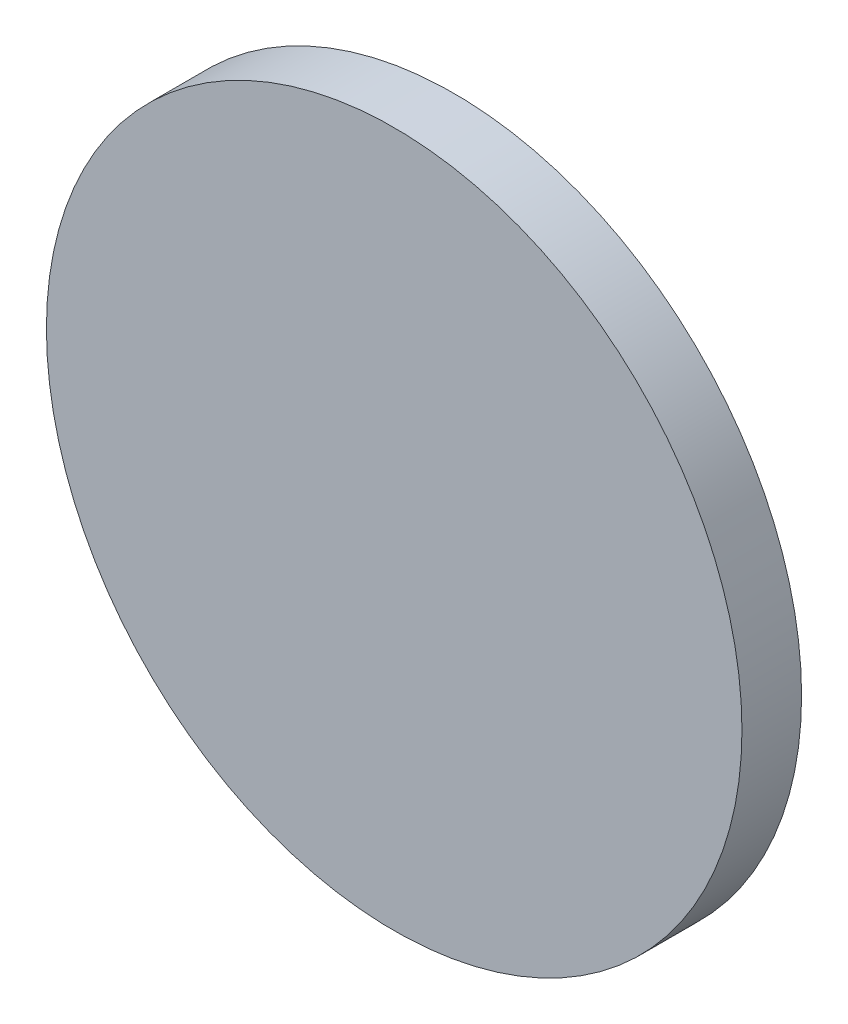
ISO-10303-21;
HEADER;
FILE_DESCRIPTION(('STEP AP214'),'2;1');
FILE_NAME('part.step','',(''),(''),'','','');
FILE_SCHEMA(('AUTOMOTIVE_DESIGN { 1 0 10303 214 1 1 1 1 }'));
ENDSEC;
DATA;
#1=APPLICATION_CONTEXT('core data for automotive mechanical design processes');
#2=APPLICATION_PROTOCOL_DEFINITION('international standard','automotive_design',2000,#1);
#3=PRODUCT_CONTEXT('',#1,'mechanical');
#4=PRODUCT('Part','Part','',(#3));
#5=PRODUCT_RELATED_PRODUCT_CATEGORY('part','',(#4));
#6=PRODUCT_DEFINITION_FORMATION('','',#4);
#7=PRODUCT_DEFINITION_CONTEXT('part definition',#1,'design');
#8=PRODUCT_DEFINITION('design','',#6,#7);
#9=PRODUCT_DEFINITION_SHAPE('','',#8);
#10=(LENGTH_UNIT() NAMED_UNIT(*) SI_UNIT(.MILLI.,.METRE.));
#11=(NAMED_UNIT(*) PLANE_ANGLE_UNIT() SI_UNIT($,.RADIAN.));
#12=(NAMED_UNIT(*) SI_UNIT($,.STERADIAN.) SOLID_ANGLE_UNIT());
#13=UNCERTAINTY_MEASURE_WITH_UNIT(LENGTH_MEASURE(1.E-05),#10,'distance_accuracy_value','');
#14=(GEOMETRIC_REPRESENTATION_CONTEXT(3) GLOBAL_UNCERTAINTY_ASSIGNED_CONTEXT((#13)) GLOBAL_UNIT_ASSIGNED_CONTEXT((#10,
#11,#12)) REPRESENTATION_CONTEXT('',''));
#15=CARTESIAN_POINT('',(0.,0.,0.));
#16=DIRECTION('',(0.,0.,1.));
#17=DIRECTION('',(1.,0.,0.));
#18=AXIS2_PLACEMENT_3D('',#15,#16,#17);
#19=CARTESIAN_POINT('',(4.7752,4.5974,0.76487));
#20=DIRECTION('',(0.,0.,-1.));
#21=DIRECTION('',(-1.,0.,0.));
#22=AXIS2_PLACEMENT_3D('',#19,#20,#21);
#23=PLANE('',#22);
#24=CARTESIAN_POINT('',(4.7752,4.5974,0.76487));
#25=DIRECTION('',(0.,0.,1.));
#26=DIRECTION('',(1.,0.,0.));
#27=AXIS2_PLACEMENT_3D('',#24,#25,#26);
#28=CIRCLE('',#27,0.200024667);
#29=CARTESIAN_POINT('',(4.975224667,4.5974,0.76487));
#30=VERTEX_POINT('',#29);
#31=EDGE_CURVE('E18',#30,#30,#28,.T.);
#32=ORIENTED_EDGE('',*,*,#31,.F.);
#33=EDGE_LOOP('',(#32));
#34=FACE_BOUND('',#33,.T.);
#35=ADVANCED_FACE('F15',(#34),#23,.T.);
#36=CARTESIAN_POINT('',(4.7752,4.5974,0.76487));
#37=DIRECTION('',(0.,0.,1.));
#38=DIRECTION('',(1.,0.,0.));
#39=AXIS2_PLACEMENT_3D('',#36,#37,#38);
#40=CYLINDRICAL_SURFACE('',#39,0.200024667);
#41=CARTESIAN_POINT('',(4.7752,4.5974,0.79916));
#42=DIRECTION('',(0.,0.,1.));
#43=DIRECTION('',(1.,0.,0.));
#44=AXIS2_PLACEMENT_3D('',#41,#42,#43);
#45=CIRCLE('',#44,0.200024667);
#46=CARTESIAN_POINT('',(4.975224667,4.5974,0.79916));
#47=VERTEX_POINT('',#46);
#48=EDGE_CURVE('E10',#47,#47,#45,.T.);
#49=ORIENTED_EDGE('',*,*,#48,.F.);
#50=EDGE_LOOP('',(#49));
#51=FACE_BOUND('',#50,.T.);
#52=ORIENTED_EDGE('',*,*,#31,.T.);
#53=EDGE_LOOP('',(#52));
#54=FACE_BOUND('',#53,.T.);
#55=ADVANCED_FACE('F27',(#51,#54),#40,.T.);
#56=CARTESIAN_POINT('',(4.7752,4.5974,0.79916));
#57=DIRECTION('',(0.,0.,1.));
#58=DIRECTION('',(1.,0.,0.));
#59=AXIS2_PLACEMENT_3D('',#56,#57,#58);
#60=PLANE('',#59);
#61=ORIENTED_EDGE('',*,*,#48,.T.);
#62=EDGE_LOOP('',(#61));
#63=FACE_BOUND('',#62,.T.);
#64=ADVANCED_FACE('F34',(#63),#60,.T.);
#65=CLOSED_SHELL('',(#35,#55,#64));
#66=MANIFOLD_SOLID_BREP('B1',#65);
#67=ADVANCED_BREP_SHAPE_REPRESENTATION('',(#18,#66),#14);
#68=SHAPE_DEFINITION_REPRESENTATION(#9,#67);
ENDSEC;
END-ISO-10303-21;
